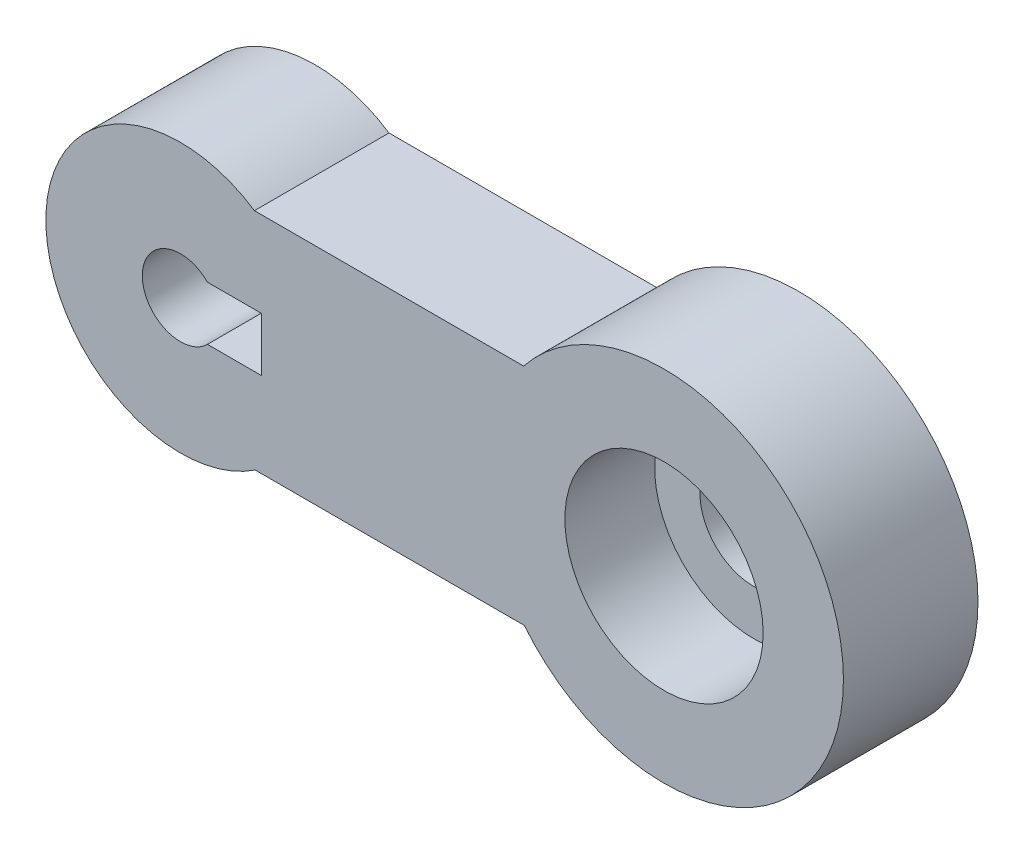
ISO-10303-21;
HEADER;
FILE_DESCRIPTION(('STEP AP214'),'2;1');
FILE_NAME('part.step','',(''),(''),'','','');
FILE_SCHEMA(('AUTOMOTIVE_DESIGN { 1 0 10303 214 1 1 1 1 }'));
ENDSEC;
DATA;
#1=APPLICATION_CONTEXT('core data for automotive mechanical design processes');
#2=APPLICATION_PROTOCOL_DEFINITION('international standard','automotive_design',2000,#1);
#3=PRODUCT_CONTEXT('',#1,'mechanical');
#4=PRODUCT('Part','Part','',(#3));
#5=PRODUCT_RELATED_PRODUCT_CATEGORY('part','',(#4));
#6=PRODUCT_DEFINITION_FORMATION('','',#4);
#7=PRODUCT_DEFINITION_CONTEXT('part definition',#1,'design');
#8=PRODUCT_DEFINITION('design','',#6,#7);
#9=PRODUCT_DEFINITION_SHAPE('','',#8);
#10=(LENGTH_UNIT() NAMED_UNIT(*) SI_UNIT(.MILLI.,.METRE.));
#11=(NAMED_UNIT(*) PLANE_ANGLE_UNIT() SI_UNIT($,.RADIAN.));
#12=(NAMED_UNIT(*) SI_UNIT($,.STERADIAN.) SOLID_ANGLE_UNIT());
#13=UNCERTAINTY_MEASURE_WITH_UNIT(LENGTH_MEASURE(1.E-05),#10,'distance_accuracy_value','');
#14=(GEOMETRIC_REPRESENTATION_CONTEXT(3) GLOBAL_UNCERTAINTY_ASSIGNED_CONTEXT((#13)) GLOBAL_UNIT_ASSIGNED_CONTEXT((#10,
#11,#12)) REPRESENTATION_CONTEXT('',''));
#15=CARTESIAN_POINT('',(0.,0.,0.));
#16=DIRECTION('',(0.,0.,1.));
#17=DIRECTION('',(1.,0.,0.));
#18=AXIS2_PLACEMENT_3D('',#15,#16,#17);
#19=CARTESIAN_POINT('',(-25.1968573373525,-3.15547707269065,15.));
#20=DIRECTION('',(0.,0.,1.));
#21=DIRECTION('',(1.,0.,0.));
#22=AXIS2_PLACEMENT_3D('',#19,#20,#21);
#23=PLANE('',#22);
#24=DIRECTION('',(1.,0.,0.));
#25=VECTOR('',#24,1.);
#26=CARTESIAN_POINT('',(-16.1864586926544,-6.15547707269065,15.));
#27=LINE('',#26,#25);
#28=CARTESIAN_POINT('',(-22.1864586926544,-6.15547707269065,15.));
#29=VERTEX_POINT('',#28);
#30=CARTESIAN_POINT('',(-16.1864586926544,-6.15547707269065,15.));
#31=VERTEX_POINT('',#30);
#32=EDGE_CURVE('E125',#29,#31,#27,.T.);
#33=ORIENTED_EDGE('',*,*,#32,.F.);
#34=CARTESIAN_POINT('',(-25.1968573373525,-3.15547707269065,15.));
#35=DIRECTION('',(0.,0.,1.));
#36=DIRECTION('',(1.,0.,0.));
#37=AXIS2_PLACEMENT_3D('',#34,#35,#36);
#38=CIRCLE('',#37,4.25);
#39=CARTESIAN_POINT('',(-22.1864586926544,-0.155477072690651,15.));
#40=VERTEX_POINT('',#39);
#41=EDGE_CURVE('E151',#40,#29,#38,.T.);
#42=ORIENTED_EDGE('',*,*,#41,.F.);
#43=DIRECTION('',(-1.,0.,0.));
#44=VECTOR('',#43,1.);
#45=CARTESIAN_POINT('',(-16.1864586926544,-0.155477072690649,15.));
#46=LINE('',#45,#44);
#47=CARTESIAN_POINT('',(-16.1864586926544,-0.155477072690649,15.));
#48=VERTEX_POINT('',#47);
#49=EDGE_CURVE('E47',#48,#40,#46,.T.);
#50=ORIENTED_EDGE('',*,*,#49,.F.);
#51=DIRECTION('',(0.,1.,0.));
#52=VECTOR('',#51,1.);
#53=CARTESIAN_POINT('',(-16.1864586926544,-0.155477072690649,15.));
#54=LINE('',#53,#52);
#55=EDGE_CURVE('E113',#31,#48,#54,.T.);
#56=ORIENTED_EDGE('',*,*,#55,.F.);
#57=EDGE_LOOP('',(#33,#42,#50,#56));
#58=FACE_BOUND('',#57,.T.);
#59=CARTESIAN_POINT('',(28.7069342344666,-3.07965510676659,15.));
#60=DIRECTION('',(0.,0.,1.));
#61=DIRECTION('',(1.,0.,0.));
#62=AXIS2_PLACEMENT_3D('',#59,#60,#61);
#63=CIRCLE('',#62,11.05);
#64=CARTESIAN_POINT('',(39.7569342344666,-3.07965510676659,15.));
#65=VERTEX_POINT('',#64);
#66=EDGE_CURVE('E144',#65,#65,#63,.T.);
#67=ORIENTED_EDGE('',*,*,#66,.F.);
#68=EDGE_LOOP('',(#67));
#69=FACE_BOUND('',#68,.T.);
#70=CARTESIAN_POINT('',(-25.1968573373525,-3.15547707269065,15.));
#71=DIRECTION('',(0.,0.,1.));
#72=DIRECTION('',(1.,0.,0.));
#73=AXIS2_PLACEMENT_3D('',#70,#71,#72);
#74=CIRCLE('',#73,15.);
#75=CARTESIAN_POINT('',(-16.9450814235796,9.37082303024788,15.));
#76=VERTEX_POINT('',#75);
#77=CARTESIAN_POINT('',(-16.8657823240034,-15.6291769697521,15.));
#78=VERTEX_POINT('',#77);
#79=EDGE_CURVE('E156',#76,#78,#74,.T.);
#80=ORIENTED_EDGE('',*,*,#79,.T.);
#81=DIRECTION('',(1.,0.,0.));
#82=VECTOR('',#81,1.);
#83=CARTESIAN_POINT('',(-16.8657823240034,-15.6291769697521,15.));
#84=LINE('',#83,#82);
#85=CARTESIAN_POINT('',(13.1342176759966,-15.6291769697521,15.));
#86=VERTEX_POINT('',#85);
#87=EDGE_CURVE('E84',#78,#86,#84,.T.);
#88=ORIENTED_EDGE('',*,*,#87,.T.);
#89=CARTESIAN_POINT('',(28.7069342344666,-3.07965510676659,15.));
#90=DIRECTION('',(0.,0.,1.));
#91=DIRECTION('',(1.,0.,0.));
#92=AXIS2_PLACEMENT_3D('',#89,#90,#91);
#93=CIRCLE('',#92,20.);
#94=CARTESIAN_POINT('',(13.0549185764204,9.37082303024788,15.));
#95=VERTEX_POINT('',#94);
#96=EDGE_CURVE('E159',#86,#95,#93,.T.);
#97=ORIENTED_EDGE('',*,*,#96,.T.);
#98=DIRECTION('',(-1.,0.,0.));
#99=VECTOR('',#98,1.);
#100=CARTESIAN_POINT('',(-16.9450814235796,9.37082303024788,15.));
#101=LINE('',#100,#99);
#102=EDGE_CURVE('E56',#95,#76,#101,.T.);
#103=ORIENTED_EDGE('',*,*,#102,.T.);
#104=EDGE_LOOP('',(#80,#88,#97,#103));
#105=FACE_BOUND('',#104,.T.);
#106=ADVANCED_FACE('F32',(#58,#69,#105),#23,.T.);
#107=CARTESIAN_POINT('',(-25.1968573373525,-3.15547707269065,0.));
#108=DIRECTION('',(0.,0.,1.));
#109=DIRECTION('',(1.,0.,0.));
#110=AXIS2_PLACEMENT_3D('',#107,#108,#109);
#111=PLANE('',#110);
#112=CARTESIAN_POINT('',(28.7069342344666,-3.07965510676659,0.));
#113=DIRECTION('',(0.,0.,1.));
#114=DIRECTION('',(1.,0.,0.));
#115=AXIS2_PLACEMENT_3D('',#112,#113,#114);
#116=CIRCLE('',#115,6.);
#117=CARTESIAN_POINT('',(34.7069342344666,-3.07965510676659,0.));
#118=VERTEX_POINT('',#117);
#119=EDGE_CURVE('E141',#118,#118,#116,.T.);
#120=ORIENTED_EDGE('',*,*,#119,.T.);
#121=EDGE_LOOP('',(#120));
#122=FACE_BOUND('',#121,.T.);
#123=CARTESIAN_POINT('',(-25.1968573373525,-3.15547707269065,0.));
#124=DIRECTION('',(0.,0.,1.));
#125=DIRECTION('',(1.,0.,0.));
#126=AXIS2_PLACEMENT_3D('',#123,#124,#125);
#127=CIRCLE('',#126,15.);
#128=CARTESIAN_POINT('',(-16.9450814235796,9.37082303024788,0.));
#129=VERTEX_POINT('',#128);
#130=CARTESIAN_POINT('',(-16.8657823240034,-15.6291769697521,0.));
#131=VERTEX_POINT('',#130);
#132=EDGE_CURVE('E154',#129,#131,#127,.T.);
#133=ORIENTED_EDGE('',*,*,#132,.F.);
#134=DIRECTION('',(-1.,0.,0.));
#135=VECTOR('',#134,1.);
#136=CARTESIAN_POINT('',(-16.9450814235796,9.37082303024788,0.));
#137=LINE('',#136,#135);
#138=CARTESIAN_POINT('',(13.0549185764204,9.37082303024788,0.));
#139=VERTEX_POINT('',#138);
#140=EDGE_CURVE('E77',#139,#129,#137,.T.);
#141=ORIENTED_EDGE('',*,*,#140,.F.);
#142=CARTESIAN_POINT('',(28.7069342344666,-3.07965510676659,0.));
#143=DIRECTION('',(0.,0.,1.));
#144=DIRECTION('',(1.,0.,0.));
#145=AXIS2_PLACEMENT_3D('',#142,#143,#144);
#146=CIRCLE('',#145,20.);
#147=CARTESIAN_POINT('',(13.1342176759966,-15.6291769697521,0.));
#148=VERTEX_POINT('',#147);
#149=EDGE_CURVE('E167',#148,#139,#146,.T.);
#150=ORIENTED_EDGE('',*,*,#149,.F.);
#151=DIRECTION('',(1.,0.,0.));
#152=VECTOR('',#151,1.);
#153=CARTESIAN_POINT('',(-16.8657823240034,-15.6291769697521,0.));
#154=LINE('',#153,#152);
#155=EDGE_CURVE('E165',#131,#148,#154,.T.);
#156=ORIENTED_EDGE('',*,*,#155,.F.);
#157=EDGE_LOOP('',(#133,#141,#150,#156));
#158=FACE_BOUND('',#157,.T.);
#159=CARTESIAN_POINT('',(-25.1968573373525,-3.15547707269065,0.));
#160=DIRECTION('',(0.,0.,1.));
#161=DIRECTION('',(1.,0.,0.));
#162=AXIS2_PLACEMENT_3D('',#159,#160,#161);
#163=CIRCLE('',#162,4.25);
#164=CARTESIAN_POINT('',(-22.1864586926544,-0.15547707269065,0.));
#165=VERTEX_POINT('',#164);
#166=CARTESIAN_POINT('',(-22.1864586926544,-6.15547707269065,0.));
#167=VERTEX_POINT('',#166);
#168=EDGE_CURVE('E148',#165,#167,#163,.T.);
#169=ORIENTED_EDGE('',*,*,#168,.T.);
#170=DIRECTION('',(1.,0.,0.));
#171=VECTOR('',#170,1.);
#172=CARTESIAN_POINT('',(-16.1864586926544,-6.15547707269065,0.));
#173=LINE('',#172,#171);
#174=CARTESIAN_POINT('',(-16.1864586926544,-6.15547707269065,0.));
#175=VERTEX_POINT('',#174);
#176=EDGE_CURVE('E115',#167,#175,#173,.T.);
#177=ORIENTED_EDGE('',*,*,#176,.T.);
#178=DIRECTION('',(0.,1.,0.));
#179=VECTOR('',#178,1.);
#180=CARTESIAN_POINT('',(-16.1864586926544,-0.155477072690649,0.));
#181=LINE('',#180,#179);
#182=CARTESIAN_POINT('',(-16.1864586926544,-0.155477072690649,0.));
#183=VERTEX_POINT('',#182);
#184=EDGE_CURVE('E110',#175,#183,#181,.T.);
#185=ORIENTED_EDGE('',*,*,#184,.T.);
#186=DIRECTION('',(-1.,0.,0.));
#187=VECTOR('',#186,1.);
#188=CARTESIAN_POINT('',(-16.1864586926544,-0.155477072690649,0.));
#189=LINE('',#188,#187);
#190=EDGE_CURVE('E118',#183,#165,#189,.T.);
#191=ORIENTED_EDGE('',*,*,#190,.T.);
#192=EDGE_LOOP('',(#169,#177,#185,#191));
#193=FACE_BOUND('',#192,.T.);
#194=ADVANCED_FACE('F124',(#122,#158,#193),#111,.F.);
#195=CARTESIAN_POINT('',(-25.1968573373525,-3.15547707269065,15.));
#196=DIRECTION('',(0.,0.,-1.));
#197=DIRECTION('',(-1.,0.,0.));
#198=AXIS2_PLACEMENT_3D('',#195,#196,#197);
#199=CYLINDRICAL_SURFACE('',#198,15.);
#200=ORIENTED_EDGE('',*,*,#132,.T.);
#201=DIRECTION('',(0.,0.,-1.));
#202=VECTOR('',#201,1.);
#203=CARTESIAN_POINT('',(-16.8657823240034,-15.6291769697521,15.));
#204=LINE('',#203,#202);
#205=EDGE_CURVE('E11',#78,#131,#204,.T.);
#206=ORIENTED_EDGE('',*,*,#205,.F.);
#207=ORIENTED_EDGE('',*,*,#79,.F.);
#208=DIRECTION('',(0.,0.,-1.));
#209=VECTOR('',#208,1.);
#210=CARTESIAN_POINT('',(-16.9450814235796,9.37082303024788,15.));
#211=LINE('',#210,#209);
#212=EDGE_CURVE('E162',#76,#129,#211,.T.);
#213=ORIENTED_EDGE('',*,*,#212,.T.);
#214=EDGE_LOOP('',(#200,#206,#207,#213));
#215=FACE_BOUND('',#214,.T.);
#216=ADVANCED_FACE('F34',(#215),#199,.T.);
#217=CARTESIAN_POINT('',(-16.8657823240034,-15.6291769697521,15.));
#218=DIRECTION('',(0.,1.,0.));
#219=DIRECTION('',(0.,0.,1.));
#220=AXIS2_PLACEMENT_3D('',#217,#218,#219);
#221=PLANE('',#220);
#222=ORIENTED_EDGE('',*,*,#155,.T.);
#223=DIRECTION('',(0.,0.,-1.));
#224=VECTOR('',#223,1.);
#225=CARTESIAN_POINT('',(13.1342176759966,-15.6291769697521,15.));
#226=LINE('',#225,#224);
#227=EDGE_CURVE('E40',#86,#148,#226,.T.);
#228=ORIENTED_EDGE('',*,*,#227,.F.);
#229=ORIENTED_EDGE('',*,*,#87,.F.);
#230=ORIENTED_EDGE('',*,*,#205,.T.);
#231=EDGE_LOOP('',(#222,#228,#229,#230));
#232=FACE_BOUND('',#231,.T.);
#233=ADVANCED_FACE('F194',(#232),#221,.F.);
#234=CARTESIAN_POINT('',(28.7069342344666,-3.07965510676659,15.));
#235=DIRECTION('',(0.,0.,-1.));
#236=DIRECTION('',(-1.,0.,0.));
#237=AXIS2_PLACEMENT_3D('',#234,#235,#236);
#238=CYLINDRICAL_SURFACE('',#237,20.);
#239=ORIENTED_EDGE('',*,*,#149,.T.);
#240=DIRECTION('',(0.,0.,-1.));
#241=VECTOR('',#240,1.);
#242=CARTESIAN_POINT('',(13.0549185764204,9.37082303024788,15.));
#243=LINE('',#242,#241);
#244=EDGE_CURVE('E171',#95,#139,#243,.T.);
#245=ORIENTED_EDGE('',*,*,#244,.F.);
#246=ORIENTED_EDGE('',*,*,#96,.F.);
#247=ORIENTED_EDGE('',*,*,#227,.T.);
#248=EDGE_LOOP('',(#239,#245,#246,#247));
#249=FACE_BOUND('',#248,.T.);
#250=ADVANCED_FACE('F176',(#249),#238,.T.);
#251=CARTESIAN_POINT('',(-16.9450814235796,9.37082303024788,15.));
#252=DIRECTION('',(0.,-1.,0.));
#253=DIRECTION('',(0.,0.,-1.));
#254=AXIS2_PLACEMENT_3D('',#251,#252,#253);
#255=PLANE('',#254);
#256=ORIENTED_EDGE('',*,*,#140,.T.);
#257=ORIENTED_EDGE('',*,*,#212,.F.);
#258=ORIENTED_EDGE('',*,*,#102,.F.);
#259=ORIENTED_EDGE('',*,*,#244,.T.);
#260=EDGE_LOOP('',(#256,#257,#258,#259));
#261=FACE_BOUND('',#260,.T.);
#262=ADVANCED_FACE('F183',(#261),#255,.F.);
#263=CARTESIAN_POINT('',(-25.1968573373525,-3.15547707269065,15.));
#264=DIRECTION('',(0.,0.,-1.));
#265=DIRECTION('',(-1.,0.,0.));
#266=AXIS2_PLACEMENT_3D('',#263,#264,#265);
#267=CYLINDRICAL_SURFACE('',#266,4.25);
#268=DIRECTION('',(0.,0.,1.));
#269=VECTOR('',#268,1.);
#270=CARTESIAN_POINT('',(-22.1864586926544,-6.15547707269065,0.));
#271=LINE('',#270,#269);
#272=EDGE_CURVE('E136',#167,#29,#271,.T.);
#273=ORIENTED_EDGE('',*,*,#272,.F.);
#274=ORIENTED_EDGE('',*,*,#168,.F.);
#275=DIRECTION('',(0.,0.,1.));
#276=VECTOR('',#275,1.);
#277=CARTESIAN_POINT('',(-22.1864586926544,-0.15547707269065,0.));
#278=LINE('',#277,#276);
#279=EDGE_CURVE('E114',#165,#40,#278,.T.);
#280=ORIENTED_EDGE('',*,*,#279,.T.);
#281=ORIENTED_EDGE('',*,*,#41,.T.);
#282=EDGE_LOOP('',(#273,#274,#280,#281));
#283=FACE_BOUND('',#282,.T.);
#284=ADVANCED_FACE('F185',(#283),#267,.F.);
#285=CARTESIAN_POINT('',(28.7069342344666,-3.07965510676659,5.));
#286=DIRECTION('',(0.,0.,1.));
#287=DIRECTION('',(1.,0.,0.));
#288=AXIS2_PLACEMENT_3D('',#285,#286,#287);
#289=CYLINDRICAL_SURFACE('',#288,11.05);
#290=CARTESIAN_POINT('',(28.7069342344666,-3.07965510676659,5.));
#291=DIRECTION('',(0.,0.,1.));
#292=DIRECTION('',(1.,0.,0.));
#293=AXIS2_PLACEMENT_3D('',#290,#291,#292);
#294=CIRCLE('',#293,11.05);
#295=CARTESIAN_POINT('',(39.7569342344666,-3.07965510676659,5.));
#296=VERTEX_POINT('',#295);
#297=EDGE_CURVE('E145',#296,#296,#294,.T.);
#298=ORIENTED_EDGE('',*,*,#297,.F.);
#299=EDGE_LOOP('',(#298));
#300=FACE_BOUND('',#299,.T.);
#301=ORIENTED_EDGE('',*,*,#66,.T.);
#302=EDGE_LOOP('',(#301));
#303=FACE_BOUND('',#302,.T.);
#304=ADVANCED_FACE('F191',(#300,#303),#289,.F.);
#305=CARTESIAN_POINT('',(28.7069342344666,-3.07965510676659,5.));
#306=DIRECTION('',(0.,0.,1.));
#307=DIRECTION('',(1.,0.,0.));
#308=AXIS2_PLACEMENT_3D('',#305,#306,#307);
#309=PLANE('',#308);
#310=CARTESIAN_POINT('',(28.7069342344666,-3.07965510676659,5.));
#311=DIRECTION('',(0.,0.,1.));
#312=DIRECTION('',(1.,0.,0.));
#313=AXIS2_PLACEMENT_3D('',#310,#311,#312);
#314=CIRCLE('',#313,6.);
#315=CARTESIAN_POINT('',(34.7069342344666,-3.07965510676659,5.));
#316=VERTEX_POINT('',#315);
#317=EDGE_CURVE('E135',#316,#316,#314,.T.);
#318=ORIENTED_EDGE('',*,*,#317,.F.);
#319=EDGE_LOOP('',(#318));
#320=FACE_BOUND('',#319,.T.);
#321=ORIENTED_EDGE('',*,*,#297,.T.);
#322=EDGE_LOOP('',(#321));
#323=FACE_BOUND('',#322,.T.);
#324=ADVANCED_FACE('F209',(#320,#323),#309,.T.);
#325=CARTESIAN_POINT('',(28.7069342344666,-3.07965510676659,-5.));
#326=DIRECTION('',(0.,0.,1.));
#327=DIRECTION('',(1.,0.,0.));
#328=AXIS2_PLACEMENT_3D('',#325,#326,#327);
#329=CYLINDRICAL_SURFACE('',#328,6.);
#330=ORIENTED_EDGE('',*,*,#317,.T.);
#331=EDGE_LOOP('',(#330));
#332=FACE_BOUND('',#331,.T.);
#333=ORIENTED_EDGE('',*,*,#119,.F.);
#334=EDGE_LOOP('',(#333));
#335=FACE_BOUND('',#334,.T.);
#336=ADVANCED_FACE('F213',(#332,#335),#329,.F.);
#337=CARTESIAN_POINT('',(-16.1864586926544,-0.155477072690649,0.));
#338=DIRECTION('',(1.,0.,0.));
#339=DIRECTION('',(0.,0.,-1.));
#340=AXIS2_PLACEMENT_3D('',#337,#338,#339);
#341=PLANE('',#340);
#342=ORIENTED_EDGE('',*,*,#55,.T.);
#343=DIRECTION('',(0.,0.,1.));
#344=VECTOR('',#343,1.);
#345=CARTESIAN_POINT('',(-16.1864586926544,-0.155477072690649,0.));
#346=LINE('',#345,#344);
#347=EDGE_CURVE('E106',#183,#48,#346,.T.);
#348=ORIENTED_EDGE('',*,*,#347,.F.);
#349=ORIENTED_EDGE('',*,*,#184,.F.);
#350=DIRECTION('',(0.,0.,1.));
#351=VECTOR('',#350,1.);
#352=CARTESIAN_POINT('',(-16.1864586926544,-6.15547707269065,0.));
#353=LINE('',#352,#351);
#354=EDGE_CURVE('E133',#175,#31,#353,.T.);
#355=ORIENTED_EDGE('',*,*,#354,.T.);
#356=EDGE_LOOP('',(#342,#348,#349,#355));
#357=FACE_BOUND('',#356,.T.);
#358=ADVANCED_FACE('F108',(#357),#341,.F.);
#359=CARTESIAN_POINT('',(-16.1864586926544,-6.15547707269065,0.));
#360=DIRECTION('',(0.,-1.,0.));
#361=DIRECTION('',(1.,0.,0.));
#362=AXIS2_PLACEMENT_3D('',#359,#360,#361);
#363=PLANE('',#362);
#364=ORIENTED_EDGE('',*,*,#32,.T.);
#365=ORIENTED_EDGE('',*,*,#354,.F.);
#366=ORIENTED_EDGE('',*,*,#176,.F.);
#367=ORIENTED_EDGE('',*,*,#272,.T.);
#368=EDGE_LOOP('',(#364,#365,#366,#367));
#369=FACE_BOUND('',#368,.T.);
#370=ADVANCED_FACE('F220',(#369),#363,.F.);
#371=CARTESIAN_POINT('',(-16.1864586926544,-0.155477072690649,0.));
#372=DIRECTION('',(0.,1.,0.));
#373=DIRECTION('',(-1.,0.,0.));
#374=AXIS2_PLACEMENT_3D('',#371,#372,#373);
#375=PLANE('',#374);
#376=ORIENTED_EDGE('',*,*,#49,.T.);
#377=ORIENTED_EDGE('',*,*,#279,.F.);
#378=ORIENTED_EDGE('',*,*,#190,.F.);
#379=ORIENTED_EDGE('',*,*,#347,.T.);
#380=EDGE_LOOP('',(#376,#377,#378,#379));
#381=FACE_BOUND('',#380,.T.);
#382=ADVANCED_FACE('F119',(#381),#375,.F.);
#383=CLOSED_SHELL('',(#106,#194,#216,#233,#250,#262,#284,#304,#324,#336,#358,#370,#382));
#384=MANIFOLD_SOLID_BREP('B2',#383);
#385=ADVANCED_BREP_SHAPE_REPRESENTATION('',(#18,#384),#14);
#386=SHAPE_DEFINITION_REPRESENTATION(#9,#385);
ENDSEC;
END-ISO-10303-21;
